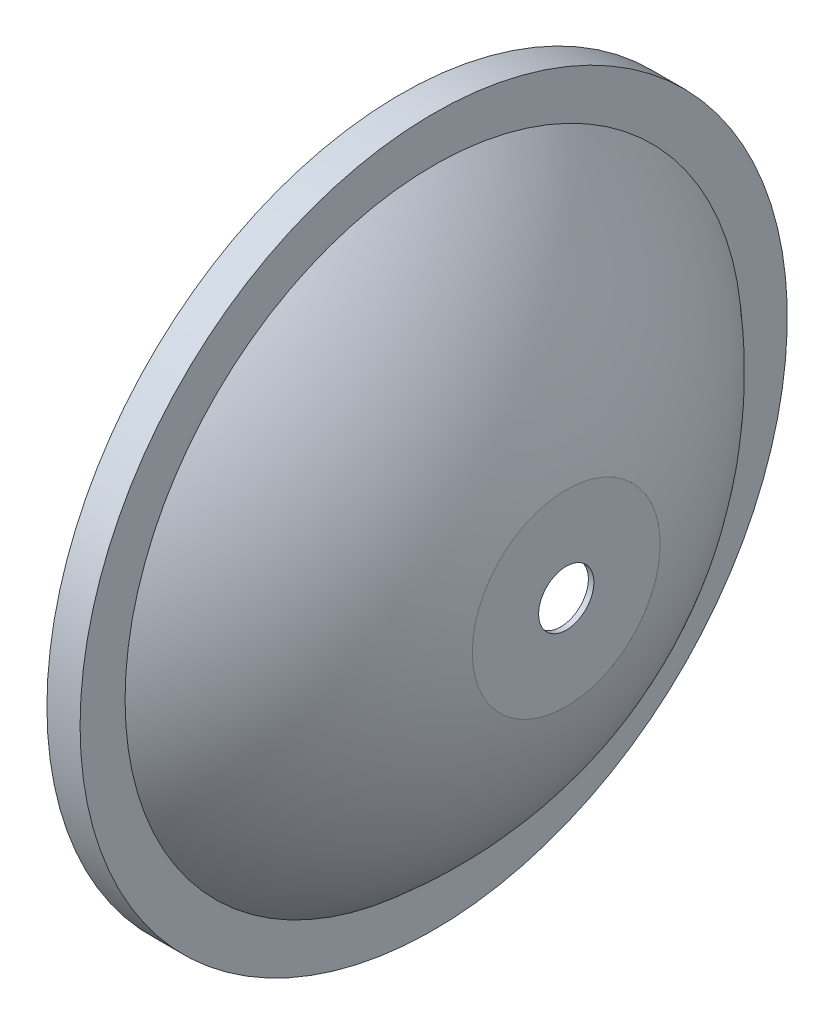
ISO-10303-21;
HEADER;
FILE_DESCRIPTION(('STEP AP214'),'2;1');
FILE_NAME('part.step','',(''),(''),'','','');
FILE_SCHEMA(('AUTOMOTIVE_DESIGN { 1 0 10303 214 1 1 1 1 }'));
ENDSEC;
DATA;
#1=APPLICATION_CONTEXT('core data for automotive mechanical design processes');
#2=APPLICATION_PROTOCOL_DEFINITION('international standard','automotive_design',2000,#1);
#3=PRODUCT_CONTEXT('',#1,'mechanical');
#4=PRODUCT('Part','Part','',(#3));
#5=PRODUCT_RELATED_PRODUCT_CATEGORY('part','',(#4));
#6=PRODUCT_DEFINITION_FORMATION('','',#4);
#7=PRODUCT_DEFINITION_CONTEXT('part definition',#1,'design');
#8=PRODUCT_DEFINITION('design','',#6,#7);
#9=PRODUCT_DEFINITION_SHAPE('','',#8);
#10=(LENGTH_UNIT() NAMED_UNIT(*) SI_UNIT(.MILLI.,.METRE.));
#11=(NAMED_UNIT(*) PLANE_ANGLE_UNIT() SI_UNIT($,.RADIAN.));
#12=(NAMED_UNIT(*) SI_UNIT($,.STERADIAN.) SOLID_ANGLE_UNIT());
#13=UNCERTAINTY_MEASURE_WITH_UNIT(LENGTH_MEASURE(1.E-05),#10,'distance_accuracy_value','');
#14=(GEOMETRIC_REPRESENTATION_CONTEXT(3) GLOBAL_UNCERTAINTY_ASSIGNED_CONTEXT((#13)) GLOBAL_UNIT_ASSIGNED_CONTEXT((#10,
#11,#12)) REPRESENTATION_CONTEXT('',''));
#15=CARTESIAN_POINT('',(0.,0.,0.));
#16=DIRECTION('',(0.,0.,1.));
#17=DIRECTION('',(1.,0.,0.));
#18=AXIS2_PLACEMENT_3D('',#15,#16,#17);
#19=CARTESIAN_POINT('',(41.,64.,0.));
#20=DIRECTION('',(1.,0.,0.));
#21=DIRECTION('',(0.,0.,-1.));
#22=AXIS2_PLACEMENT_3D('',#19,#20,#21);
#23=PLANE('',#22);
#24=CARTESIAN_POINT('',(41.,0.,0.));
#25=DIRECTION('',(-1.,0.,0.));
#26=DIRECTION('',(0.,0.,1.));
#27=AXIS2_PLACEMENT_3D('',#24,#25,#26);
#28=CIRCLE('',#27,63.);
#29=CARTESIAN_POINT('',(41.,0.,63.));
#30=VERTEX_POINT('',#29);
#31=EDGE_CURVE('E82',#30,#30,#28,.T.);
#32=ORIENTED_EDGE('',*,*,#31,.F.);
#33=EDGE_LOOP('',(#32));
#34=FACE_BOUND('',#33,.T.);
#35=CARTESIAN_POINT('',(41.,0.,0.));
#36=DIRECTION('',(-1.,0.,0.));
#37=DIRECTION('',(0.,0.,1.));
#38=AXIS2_PLACEMENT_3D('',#35,#36,#37);
#39=CIRCLE('',#38,64.);
#40=CARTESIAN_POINT('',(41.,0.,64.));
#41=VERTEX_POINT('',#40);
#42=EDGE_CURVE('E10',#41,#41,#39,.T.);
#43=ORIENTED_EDGE('',*,*,#42,.T.);
#44=EDGE_LOOP('',(#43));
#45=FACE_BOUND('',#44,.T.);
#46=ADVANCED_FACE('F39',(#34,#45),#23,.F.);
#47=CARTESIAN_POINT('',(0.,0.,0.));
#48=DIRECTION('',(-1.,0.,0.));
#49=DIRECTION('',(0.,0.,1.));
#50=AXIS2_PLACEMENT_3D('',#47,#48,#49);
#51=CYLINDRICAL_SURFACE('',#50,64.);
#52=ORIENTED_EDGE('',*,*,#42,.F.);
#53=EDGE_LOOP('',(#52));
#54=FACE_BOUND('',#53,.T.);
#55=CARTESIAN_POINT('',(47.,0.,0.));
#56=DIRECTION('',(-1.,0.,0.));
#57=DIRECTION('',(0.,0.,1.));
#58=AXIS2_PLACEMENT_3D('',#55,#56,#57);
#59=CIRCLE('',#58,64.);
#60=CARTESIAN_POINT('',(47.,0.,64.));
#61=VERTEX_POINT('',#60);
#62=EDGE_CURVE('E46',#61,#61,#59,.T.);
#63=ORIENTED_EDGE('',*,*,#62,.T.);
#64=EDGE_LOOP('',(#63));
#65=FACE_BOUND('',#64,.T.);
#66=ADVANCED_FACE('F90',(#54,#65),#51,.T.);
#67=CARTESIAN_POINT('',(47.,64.,0.));
#68=DIRECTION('',(-1.,0.,0.));
#69=DIRECTION('',(0.,0.,1.));
#70=AXIS2_PLACEMENT_3D('',#67,#68,#69);
#71=PLANE('',#70);
#72=ORIENTED_EDGE('',*,*,#62,.F.);
#73=EDGE_LOOP('',(#72));
#74=FACE_BOUND('',#73,.T.);
#75=CARTESIAN_POINT('',(47.,0.,0.));
#76=DIRECTION('',(-1.,0.,0.));
#77=DIRECTION('',(0.,0.,1.));
#78=AXIS2_PLACEMENT_3D('',#75,#76,#77);
#79=CIRCLE('',#78,55.8569601750758);
#80=CARTESIAN_POINT('',(47.,0.,55.8569601750758));
#81=VERTEX_POINT('',#80);
#82=EDGE_CURVE('E51',#81,#81,#79,.T.);
#83=ORIENTED_EDGE('',*,*,#82,.T.);
#84=EDGE_LOOP('',(#83));
#85=FACE_BOUND('',#84,.T.);
#86=ADVANCED_FACE('F94',(#74,#85),#71,.F.);
#87=CARTESIAN_POINT('',(0.,0.,0.));
#88=DIRECTION('',(-1.,0.,0.));
#89=DIRECTION('',(0.,1.,0.));
#90=AXIS2_PLACEMENT_3D('',#87,#88,#89);
#91=SPHERICAL_SURFACE('',#90,73.);
#92=ORIENTED_EDGE('',*,*,#82,.F.);
#93=EDGE_LOOP('',(#92));
#94=FACE_BOUND('',#93,.T.);
#95=CARTESIAN_POINT('',(70.9929573971954,0.,0.));
#96=DIRECTION('',(-1.,0.,0.));
#97=DIRECTION('',(0.,0.,1.));
#98=AXIS2_PLACEMENT_3D('',#95,#96,#97);
#99=CIRCLE('',#98,17.);
#100=CARTESIAN_POINT('',(70.9929573971954,0.,17.));
#101=VERTEX_POINT('',#100);
#102=EDGE_CURVE('E56',#101,#101,#99,.T.);
#103=ORIENTED_EDGE('',*,*,#102,.T.);
#104=EDGE_LOOP('',(#103));
#105=FACE_BOUND('',#104,.T.);
#106=ADVANCED_FACE('F99',(#94,#105),#91,.T.);
#107=CARTESIAN_POINT('',(70.9929573971954,17.,0.));
#108=DIRECTION('',(-1.,0.,0.));
#109=DIRECTION('',(0.,0.,1.));
#110=AXIS2_PLACEMENT_3D('',#107,#108,#109);
#111=PLANE('',#110);
#112=ORIENTED_EDGE('',*,*,#102,.F.);
#113=EDGE_LOOP('',(#112));
#114=FACE_BOUND('',#113,.T.);
#115=CARTESIAN_POINT('',(70.9929573971954,0.,0.));
#116=DIRECTION('',(-1.,0.,0.));
#117=DIRECTION('',(0.,0.,1.));
#118=AXIS2_PLACEMENT_3D('',#115,#116,#117);
#119=CIRCLE('',#118,5.);
#120=CARTESIAN_POINT('',(70.9929573971954,0.,5.));
#121=VERTEX_POINT('',#120);
#122=EDGE_CURVE('E62',#121,#121,#119,.T.);
#123=ORIENTED_EDGE('',*,*,#122,.T.);
#124=EDGE_LOOP('',(#123));
#125=FACE_BOUND('',#124,.T.);
#126=ADVANCED_FACE('F105',(#114,#125),#111,.F.);
#127=CARTESIAN_POINT('',(0.,0.,0.));
#128=DIRECTION('',(-1.,0.,0.));
#129=DIRECTION('',(0.,0.,1.));
#130=AXIS2_PLACEMENT_3D('',#127,#128,#129);
#131=CYLINDRICAL_SURFACE('',#130,5.);
#132=ORIENTED_EDGE('',*,*,#122,.F.);
#133=EDGE_LOOP('',(#132));
#134=FACE_BOUND('',#133,.T.);
#135=CARTESIAN_POINT('',(69.9929573971954,0.,0.));
#136=DIRECTION('',(-1.,0.,0.));
#137=DIRECTION('',(0.,0.,1.));
#138=AXIS2_PLACEMENT_3D('',#135,#136,#137);
#139=CIRCLE('',#138,5.);
#140=CARTESIAN_POINT('',(69.9929573971954,0.,5.));
#141=VERTEX_POINT('',#140);
#142=EDGE_CURVE('E66',#141,#141,#139,.T.);
#143=ORIENTED_EDGE('',*,*,#142,.T.);
#144=EDGE_LOOP('',(#143));
#145=FACE_BOUND('',#144,.T.);
#146=ADVANCED_FACE('F109',(#134,#145),#131,.F.);
#147=CARTESIAN_POINT('',(69.9929573971954,16.881525843193,0.));
#148=DIRECTION('',(1.,0.,0.));
#149=DIRECTION('',(0.,0.,-1.));
#150=AXIS2_PLACEMENT_3D('',#147,#148,#149);
#151=PLANE('',#150);
#152=ORIENTED_EDGE('',*,*,#142,.F.);
#153=EDGE_LOOP('',(#152));
#154=FACE_BOUND('',#153,.T.);
#155=CARTESIAN_POINT('',(69.9929573971954,0.,0.));
#156=DIRECTION('',(-1.,0.,0.));
#157=DIRECTION('',(0.,0.,1.));
#158=AXIS2_PLACEMENT_3D('',#155,#156,#157);
#159=CIRCLE('',#158,16.881525843193);
#160=CARTESIAN_POINT('',(69.9929573971954,0.,16.881525843193));
#161=VERTEX_POINT('',#160);
#162=EDGE_CURVE('E70',#161,#161,#159,.T.);
#163=ORIENTED_EDGE('',*,*,#162,.T.);
#164=EDGE_LOOP('',(#163));
#165=FACE_BOUND('',#164,.T.);
#166=ADVANCED_FACE('F113',(#154,#165),#151,.F.);
#167=CARTESIAN_POINT('',(0.,0.,0.));
#168=DIRECTION('',(-1.,0.,0.));
#169=DIRECTION('',(0.,1.,0.));
#170=AXIS2_PLACEMENT_3D('',#167,#168,#169);
#171=SPHERICAL_SURFACE('',#170,72.);
#172=ORIENTED_EDGE('',*,*,#162,.F.);
#173=EDGE_LOOP('',(#172));
#174=FACE_BOUND('',#173,.T.);
#175=CARTESIAN_POINT('',(46.,0.,0.));
#176=DIRECTION('',(-1.,0.,0.));
#177=DIRECTION('',(0.,0.,1.));
#178=AXIS2_PLACEMENT_3D('',#175,#176,#177);
#179=CIRCLE('',#178,55.3895296965049);
#180=CARTESIAN_POINT('',(46.,0.,55.3895296965049));
#181=VERTEX_POINT('',#180);
#182=EDGE_CURVE('E74',#181,#181,#179,.T.);
#183=ORIENTED_EDGE('',*,*,#182,.T.);
#184=EDGE_LOOP('',(#183));
#185=FACE_BOUND('',#184,.T.);
#186=ADVANCED_FACE('F117',(#174,#185),#171,.F.);
#187=CARTESIAN_POINT('',(46.,63.,0.));
#188=DIRECTION('',(1.,0.,0.));
#189=DIRECTION('',(0.,0.,-1.));
#190=AXIS2_PLACEMENT_3D('',#187,#188,#189);
#191=PLANE('',#190);
#192=ORIENTED_EDGE('',*,*,#182,.F.);
#193=EDGE_LOOP('',(#192));
#194=FACE_BOUND('',#193,.T.);
#195=CARTESIAN_POINT('',(46.,0.,0.));
#196=DIRECTION('',(-1.,0.,0.));
#197=DIRECTION('',(0.,0.,1.));
#198=AXIS2_PLACEMENT_3D('',#195,#196,#197);
#199=CIRCLE('',#198,63.);
#200=CARTESIAN_POINT('',(46.,0.,63.));
#201=VERTEX_POINT('',#200);
#202=EDGE_CURVE('E78',#201,#201,#199,.T.);
#203=ORIENTED_EDGE('',*,*,#202,.T.);
#204=EDGE_LOOP('',(#203));
#205=FACE_BOUND('',#204,.T.);
#206=ADVANCED_FACE('F121',(#194,#205),#191,.F.);
#207=CARTESIAN_POINT('',(0.,0.,0.));
#208=DIRECTION('',(-1.,0.,0.));
#209=DIRECTION('',(0.,0.,1.));
#210=AXIS2_PLACEMENT_3D('',#207,#208,#209);
#211=CYLINDRICAL_SURFACE('',#210,63.);
#212=ORIENTED_EDGE('',*,*,#202,.F.);
#213=EDGE_LOOP('',(#212));
#214=FACE_BOUND('',#213,.T.);
#215=ORIENTED_EDGE('',*,*,#31,.T.);
#216=EDGE_LOOP('',(#215));
#217=FACE_BOUND('',#216,.T.);
#218=ADVANCED_FACE('F87',(#214,#217),#211,.F.);
#219=CLOSED_SHELL('',(#46,#66,#86,#106,#126,#146,#166,#186,#206,#218));
#220=MANIFOLD_SOLID_BREP('B2',#219);
#221=ADVANCED_BREP_SHAPE_REPRESENTATION('',(#18,#220),#14);
#222=SHAPE_DEFINITION_REPRESENTATION(#9,#221);
ENDSEC;
END-ISO-10303-21;
